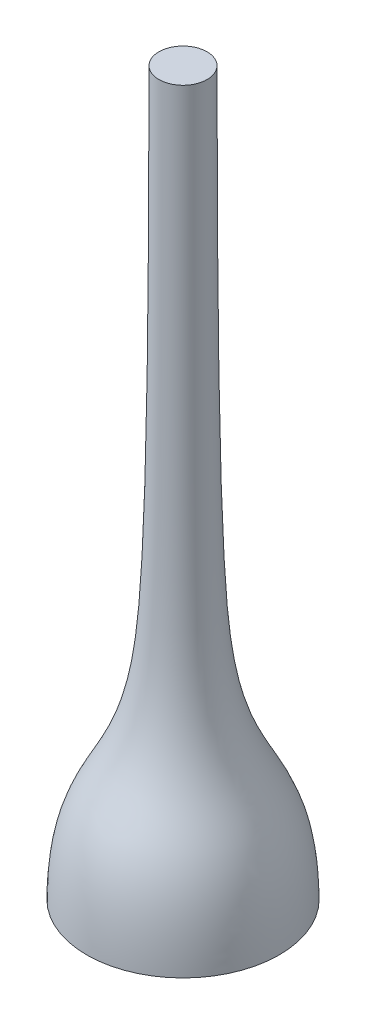
ISO-10303-21;
HEADER;
FILE_DESCRIPTION(('STEP AP214'),'2;1');
FILE_NAME('part.step','',(''),(''),'','','');
FILE_SCHEMA(('AUTOMOTIVE_DESIGN { 1 0 10303 214 1 1 1 1 }'));
ENDSEC;
DATA;
#1=APPLICATION_CONTEXT('core data for automotive mechanical design processes');
#2=APPLICATION_PROTOCOL_DEFINITION('international standard','automotive_design',2000,#1);
#3=PRODUCT_CONTEXT('',#1,'mechanical');
#4=PRODUCT('Part','Part','',(#3));
#5=PRODUCT_RELATED_PRODUCT_CATEGORY('part','',(#4));
#6=PRODUCT_DEFINITION_FORMATION('','',#4);
#7=PRODUCT_DEFINITION_CONTEXT('part definition',#1,'design');
#8=PRODUCT_DEFINITION('design','',#6,#7);
#9=PRODUCT_DEFINITION_SHAPE('','',#8);
#10=(LENGTH_UNIT() NAMED_UNIT(*) SI_UNIT(.MILLI.,.METRE.));
#11=(NAMED_UNIT(*) PLANE_ANGLE_UNIT() SI_UNIT($,.RADIAN.));
#12=(NAMED_UNIT(*) SI_UNIT($,.STERADIAN.) SOLID_ANGLE_UNIT());
#13=UNCERTAINTY_MEASURE_WITH_UNIT(LENGTH_MEASURE(1.E-05),#10,'distance_accuracy_value','');
#14=(GEOMETRIC_REPRESENTATION_CONTEXT(3) GLOBAL_UNCERTAINTY_ASSIGNED_CONTEXT((#13)) GLOBAL_UNIT_ASSIGNED_CONTEXT((#10,
#11,#12)) REPRESENTATION_CONTEXT('',''));
#15=CARTESIAN_POINT('',(0.,0.,0.));
#16=DIRECTION('',(0.,0.,1.));
#17=DIRECTION('',(1.,0.,0.));
#18=AXIS2_PLACEMENT_3D('',#15,#16,#17);
#19=CARTESIAN_POINT('',(0.,15.,0.));
#20=DIRECTION('',(0.,-1.,0.));
#21=DIRECTION('',(0.,0.,-1.));
#22=AXIS2_PLACEMENT_3D('',#19,#20,#21);
#23=PLANE('',#22);
#24=CARTESIAN_POINT('',(0.,15.,0.));
#25=DIRECTION('',(0.,1.,0.));
#26=DIRECTION('',(0.,0.,1.));
#27=AXIS2_PLACEMENT_3D('',#24,#25,#26);
#28=CIRCLE('',#27,0.5);
#29=CARTESIAN_POINT('',(0.,15.,0.5));
#30=VERTEX_POINT('',#29);
#31=EDGE_CURVE('E10',#30,#30,#28,.T.);
#32=ORIENTED_EDGE('',*,*,#31,.T.);
#33=EDGE_LOOP('',(#32));
#34=FACE_BOUND('',#33,.T.);
#35=ADVANCED_FACE('F32',(#34),#23,.F.);
#36=CARTESIAN_POINT('',(2.,0.,0.));
#37=CARTESIAN_POINT('',(1.96995028212624,2.3514531969424,0.));
#38=CARTESIAN_POINT('',(0.941978143292364,2.03355611013739,0.));
#39=CARTESIAN_POINT('',(0.571405700022448,5.99492601884955,0.));
#40=CARTESIAN_POINT('',(0.501667506782302,9.66079199707474,0.));
#41=CARTESIAN_POINT('',(0.5,15.,0.));
#42=B_SPLINE_CURVE_WITH_KNOTS('',3,(#36,#37,#38,#39,#40,#41),.UNSPECIFIED.,.F.,.F.,(4,1,1,4),
(0.,0.669768410961681,0.769768410961681,1.),.UNSPECIFIED.);
#43=CARTESIAN_POINT('',(0.,15.,0.));
#44=DIRECTION('',(0.,1.,0.));
#45=AXIS1_PLACEMENT('',#43,#44);
#46=SURFACE_OF_REVOLUTION('',#42,#45);
#47=ORIENTED_EDGE('',*,*,#31,.F.);
#48=EDGE_LOOP('',(#47));
#49=FACE_BOUND('',#48,.T.);
#50=CARTESIAN_POINT('',(0.,0.,0.));
#51=DIRECTION('',(0.,1.,0.));
#52=DIRECTION('',(0.,0.,1.));
#53=AXIS2_PLACEMENT_3D('',#50,#51,#52);
#54=CIRCLE('',#53,2.);
#55=CARTESIAN_POINT('',(0.,0.,2.));
#56=VERTEX_POINT('',#55);
#57=EDGE_CURVE('E38',#56,#56,#54,.T.);
#58=ORIENTED_EDGE('',*,*,#57,.T.);
#59=EDGE_LOOP('',(#58));
#60=FACE_BOUND('',#59,.T.);
#61=ADVANCED_FACE('F51',(#49,#60),#46,.T.);
#62=CARTESIAN_POINT('',(0.,0.,0.));
#63=DIRECTION('',(0.,1.,0.));
#64=DIRECTION('',(0.,0.,1.));
#65=AXIS2_PLACEMENT_3D('',#62,#63,#64);
#66=PLANE('',#65);
#67=ORIENTED_EDGE('',*,*,#57,.F.);
#68=EDGE_LOOP('',(#67));
#69=FACE_BOUND('',#68,.T.);
#70=ADVANCED_FACE('F54',(#69),#66,.F.);
#71=CLOSED_SHELL('',(#35,#61,#70));
#72=MANIFOLD_SOLID_BREP('B2',#71);
#73=ADVANCED_BREP_SHAPE_REPRESENTATION('',(#18,#72),#14);
#74=SHAPE_DEFINITION_REPRESENTATION(#9,#73);
ENDSEC;
END-ISO-10303-21;
